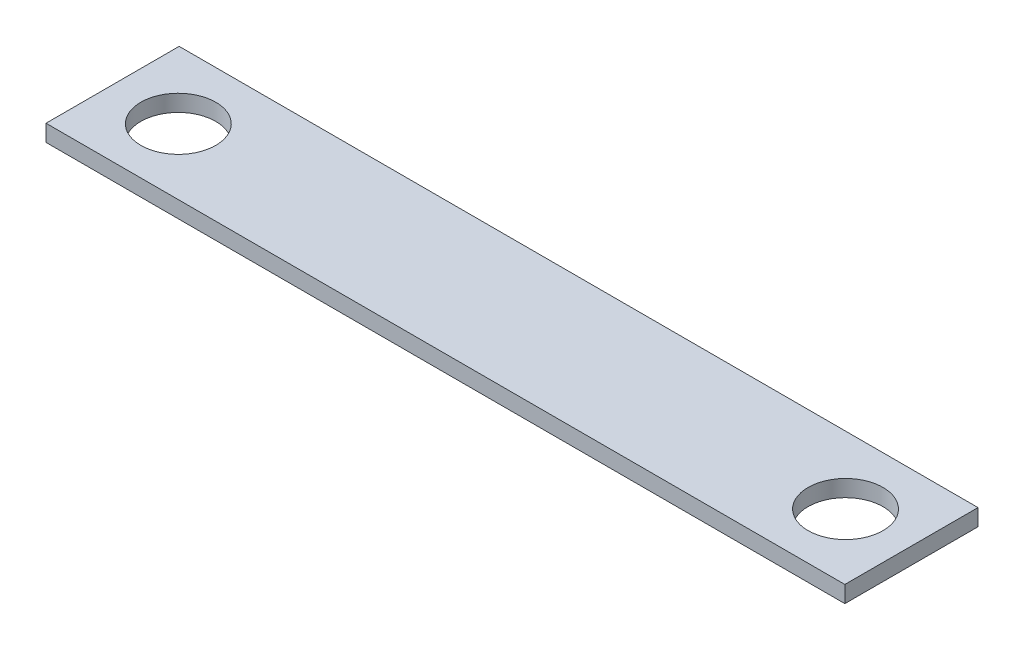
ISO-10303-21;
HEADER;
FILE_DESCRIPTION(('STEP AP214'),'2;1');
FILE_NAME('part.step','',(''),(''),'','','');
FILE_SCHEMA(('AUTOMOTIVE_DESIGN { 1 0 10303 214 1 1 1 1 }'));
ENDSEC;
DATA;
#1=APPLICATION_CONTEXT('core data for automotive mechanical design processes');
#2=APPLICATION_PROTOCOL_DEFINITION('international standard','automotive_design',2000,#1);
#3=PRODUCT_CONTEXT('',#1,'mechanical');
#4=PRODUCT('Part','Part','',(#3));
#5=PRODUCT_RELATED_PRODUCT_CATEGORY('part','',(#4));
#6=PRODUCT_DEFINITION_FORMATION('','',#4);
#7=PRODUCT_DEFINITION_CONTEXT('part definition',#1,'design');
#8=PRODUCT_DEFINITION('design','',#6,#7);
#9=PRODUCT_DEFINITION_SHAPE('','',#8);
#10=(LENGTH_UNIT() NAMED_UNIT(*) SI_UNIT(.MILLI.,.METRE.));
#11=(NAMED_UNIT(*) PLANE_ANGLE_UNIT() SI_UNIT($,.RADIAN.));
#12=(NAMED_UNIT(*) SI_UNIT($,.STERADIAN.) SOLID_ANGLE_UNIT());
#13=UNCERTAINTY_MEASURE_WITH_UNIT(LENGTH_MEASURE(1.E-05),#10,'distance_accuracy_value','');
#14=(GEOMETRIC_REPRESENTATION_CONTEXT(3) GLOBAL_UNCERTAINTY_ASSIGNED_CONTEXT((#13)) GLOBAL_UNIT_ASSIGNED_CONTEXT((#10,
#11,#12)) REPRESENTATION_CONTEXT('',''));
#15=CARTESIAN_POINT('',(0.,0.,0.));
#16=DIRECTION('',(0.,0.,1.));
#17=DIRECTION('',(1.,0.,0.));
#18=AXIS2_PLACEMENT_3D('',#15,#16,#17);
#19=CARTESIAN_POINT('',(-137.846486486486,6.35,-47.7794594594595));
#20=DIRECTION('',(1.,0.,0.));
#21=DIRECTION('',(0.,0.,-1.));
#22=AXIS2_PLACEMENT_3D('',#19,#20,#21);
#23=PLANE('',#22);
#24=DIRECTION('',(0.,0.,1.));
#25=VECTOR('',#24,1.);
#26=CARTESIAN_POINT('',(-137.846486486486,0.,-47.7794594594595));
#27=LINE('',#26,#25);
#28=CARTESIAN_POINT('',(-137.846486486486,0.,-47.7794594594595));
#29=VERTEX_POINT('',#28);
#30=CARTESIAN_POINT('',(-137.846486486486,0.,3.02054054054053));
#31=VERTEX_POINT('',#30);
#32=EDGE_CURVE('E107',#29,#31,#27,.T.);
#33=ORIENTED_EDGE('',*,*,#32,.T.);
#34=DIRECTION('',(0.,-1.,0.));
#35=VECTOR('',#34,1.);
#36=CARTESIAN_POINT('',(-137.846486486486,6.35,3.02054054054053));
#37=LINE('',#36,#35);
#38=CARTESIAN_POINT('',(-137.846486486486,6.35,3.02054054054053));
#39=VERTEX_POINT('',#38);
#40=EDGE_CURVE('E11',#39,#31,#37,.T.);
#41=ORIENTED_EDGE('',*,*,#40,.F.);
#42=DIRECTION('',(0.,0.,1.));
#43=VECTOR('',#42,1.);
#44=CARTESIAN_POINT('',(-137.846486486486,6.35,-47.7794594594595));
#45=LINE('',#44,#43);
#46=CARTESIAN_POINT('',(-137.846486486486,6.35,-47.7794594594595));
#47=VERTEX_POINT('',#46);
#48=EDGE_CURVE('E91',#47,#39,#45,.T.);
#49=ORIENTED_EDGE('',*,*,#48,.F.);
#50=DIRECTION('',(0.,-1.,0.));
#51=VECTOR('',#50,1.);
#52=CARTESIAN_POINT('',(-137.846486486486,6.35,-47.7794594594595));
#53=LINE('',#52,#51);
#54=EDGE_CURVE('E103',#47,#29,#53,.T.);
#55=ORIENTED_EDGE('',*,*,#54,.T.);
#56=EDGE_LOOP('',(#33,#41,#49,#55));
#57=FACE_BOUND('',#56,.T.);
#58=ADVANCED_FACE('F39',(#57),#23,.F.);
#59=CARTESIAN_POINT('',(-137.846486486486,6.35,3.02054054054053));
#60=DIRECTION('',(0.,0.,-1.));
#61=DIRECTION('',(-1.,0.,0.));
#62=AXIS2_PLACEMENT_3D('',#59,#60,#61);
#63=PLANE('',#62);
#64=DIRECTION('',(1.,0.,0.));
#65=VECTOR('',#64,1.);
#66=CARTESIAN_POINT('',(-137.846486486486,0.,3.02054054054053));
#67=LINE('',#66,#65);
#68=CARTESIAN_POINT('',(166.953513513514,0.,3.02054054054053));
#69=VERTEX_POINT('',#68);
#70=EDGE_CURVE('E96',#31,#69,#67,.T.);
#71=ORIENTED_EDGE('',*,*,#70,.T.);
#72=DIRECTION('',(0.,-1.,0.));
#73=VECTOR('',#72,1.);
#74=CARTESIAN_POINT('',(166.953513513514,6.35,3.02054054054053));
#75=LINE('',#74,#73);
#76=CARTESIAN_POINT('',(166.953513513514,6.35,3.02054054054053));
#77=VERTEX_POINT('',#76);
#78=EDGE_CURVE('E48',#77,#69,#75,.T.);
#79=ORIENTED_EDGE('',*,*,#78,.F.);
#80=DIRECTION('',(1.,0.,0.));
#81=VECTOR('',#80,1.);
#82=CARTESIAN_POINT('',(-137.846486486486,6.35,3.02054054054053));
#83=LINE('',#82,#81);
#84=EDGE_CURVE('E86',#39,#77,#83,.T.);
#85=ORIENTED_EDGE('',*,*,#84,.F.);
#86=ORIENTED_EDGE('',*,*,#40,.T.);
#87=EDGE_LOOP('',(#71,#79,#85,#86));
#88=FACE_BOUND('',#87,.T.);
#89=ADVANCED_FACE('F95',(#88),#63,.F.);
#90=CARTESIAN_POINT('',(166.953513513514,6.35,-47.7794594594595));
#91=DIRECTION('',(-1.,0.,0.));
#92=DIRECTION('',(0.,0.,1.));
#93=AXIS2_PLACEMENT_3D('',#90,#91,#92);
#94=PLANE('',#93);
#95=DIRECTION('',(0.,0.,-1.));
#96=VECTOR('',#95,1.);
#97=CARTESIAN_POINT('',(166.953513513514,0.,-47.7794594594595));
#98=LINE('',#97,#96);
#99=CARTESIAN_POINT('',(166.953513513514,0.,-47.7794594594595));
#100=VERTEX_POINT('',#99);
#101=EDGE_CURVE('E73',#69,#100,#98,.T.);
#102=ORIENTED_EDGE('',*,*,#101,.T.);
#103=DIRECTION('',(0.,-1.,0.));
#104=VECTOR('',#103,1.);
#105=CARTESIAN_POINT('',(166.953513513514,6.35,-47.7794594594595));
#106=LINE('',#105,#104);
#107=CARTESIAN_POINT('',(166.953513513514,6.35,-47.7794594594595));
#108=VERTEX_POINT('',#107);
#109=EDGE_CURVE('E98',#108,#100,#106,.T.);
#110=ORIENTED_EDGE('',*,*,#109,.F.);
#111=DIRECTION('',(0.,0.,-1.));
#112=VECTOR('',#111,1.);
#113=CARTESIAN_POINT('',(166.953513513514,6.35,-47.7794594594595));
#114=LINE('',#113,#112);
#115=EDGE_CURVE('E89',#77,#108,#114,.T.);
#116=ORIENTED_EDGE('',*,*,#115,.F.);
#117=ORIENTED_EDGE('',*,*,#78,.T.);
#118=EDGE_LOOP('',(#102,#110,#116,#117));
#119=FACE_BOUND('',#118,.T.);
#120=ADVANCED_FACE('F99',(#119),#94,.F.);
#121=CARTESIAN_POINT('',(-137.846486486486,6.35,-47.7794594594595));
#122=DIRECTION('',(0.,0.,1.));
#123=DIRECTION('',(1.,0.,0.));
#124=AXIS2_PLACEMENT_3D('',#121,#122,#123);
#125=PLANE('',#124);
#126=DIRECTION('',(-1.,0.,0.));
#127=VECTOR('',#126,1.);
#128=CARTESIAN_POINT('',(-137.846486486486,0.,-47.7794594594595));
#129=LINE('',#128,#127);
#130=EDGE_CURVE('E79',#100,#29,#129,.T.);
#131=ORIENTED_EDGE('',*,*,#130,.T.);
#132=ORIENTED_EDGE('',*,*,#54,.F.);
#133=DIRECTION('',(-1.,0.,0.));
#134=VECTOR('',#133,1.);
#135=CARTESIAN_POINT('',(-137.846486486486,6.35,-47.7794594594595));
#136=LINE('',#135,#134);
#137=EDGE_CURVE('E56',#108,#47,#136,.T.);
#138=ORIENTED_EDGE('',*,*,#137,.F.);
#139=ORIENTED_EDGE('',*,*,#109,.T.);
#140=EDGE_LOOP('',(#131,#132,#138,#139));
#141=FACE_BOUND('',#140,.T.);
#142=ADVANCED_FACE('F121',(#141),#125,.F.);
#143=CARTESIAN_POINT('',(0.,6.35,0.));
#144=DIRECTION('',(0.,1.,0.));
#145=DIRECTION('',(0.,0.,1.));
#146=AXIS2_PLACEMENT_3D('',#143,#144,#145);
#147=PLANE('',#146);
#148=CARTESIAN_POINT('',(-112.415422728969,6.35,-22.0276218651188));
#149=DIRECTION('',(0.,1.,0.));
#150=DIRECTION('',(0.,0.,1.));
#151=AXIS2_PLACEMENT_3D('',#148,#149,#150);
#152=CIRCLE('',#151,14.2875);
#153=CARTESIAN_POINT('',(-112.415422728969,6.35,-7.74012186511876));
#154=VERTEX_POINT('',#153);
#155=EDGE_CURVE('E136',#154,#154,#152,.T.);
#156=ORIENTED_EDGE('',*,*,#155,.F.);
#157=EDGE_LOOP('',(#156));
#158=FACE_BOUND('',#157,.T.);
#159=CARTESIAN_POINT('',(142.165858982464,6.35,-22.0276218651188));
#160=DIRECTION('',(0.,1.,0.));
#161=DIRECTION('',(0.,0.,1.));
#162=AXIS2_PLACEMENT_3D('',#159,#160,#161);
#163=CIRCLE('',#162,14.2875);
#164=CARTESIAN_POINT('',(142.165858982464,6.35,-7.74012186511875));
#165=VERTEX_POINT('',#164);
#166=EDGE_CURVE('E128',#165,#165,#163,.T.);
#167=ORIENTED_EDGE('',*,*,#166,.F.);
#168=EDGE_LOOP('',(#167));
#169=FACE_BOUND('',#168,.T.);
#170=ORIENTED_EDGE('',*,*,#48,.T.);
#171=ORIENTED_EDGE('',*,*,#84,.T.);
#172=ORIENTED_EDGE('',*,*,#115,.T.);
#173=ORIENTED_EDGE('',*,*,#137,.T.);
#174=EDGE_LOOP('',(#170,#171,#172,#173));
#175=FACE_BOUND('',#174,.T.);
#176=ADVANCED_FACE('F87',(#158,#169,#175),#147,.T.);
#177=CARTESIAN_POINT('',(0.,0.,0.));
#178=DIRECTION('',(0.,1.,0.));
#179=DIRECTION('',(0.,0.,1.));
#180=AXIS2_PLACEMENT_3D('',#177,#178,#179);
#181=PLANE('',#180);
#182=CARTESIAN_POINT('',(-112.415422728969,0.,-22.0276218651188));
#183=DIRECTION('',(0.,1.,0.));
#184=DIRECTION('',(0.,0.,1.));
#185=AXIS2_PLACEMENT_3D('',#182,#183,#184);
#186=CIRCLE('',#185,14.2875);
#187=CARTESIAN_POINT('',(-112.415422728969,0.,-7.74012186511876));
#188=VERTEX_POINT('',#187);
#189=EDGE_CURVE('E111',#188,#188,#186,.T.);
#190=ORIENTED_EDGE('',*,*,#189,.T.);
#191=EDGE_LOOP('',(#190));
#192=FACE_BOUND('',#191,.T.);
#193=CARTESIAN_POINT('',(142.165858982464,0.,-22.0276218651188));
#194=DIRECTION('',(0.,1.,0.));
#195=DIRECTION('',(0.,0.,1.));
#196=AXIS2_PLACEMENT_3D('',#193,#194,#195);
#197=CIRCLE('',#196,14.2875);
#198=CARTESIAN_POINT('',(142.165858982464,0.,-7.74012186511875));
#199=VERTEX_POINT('',#198);
#200=EDGE_CURVE('E132',#199,#199,#197,.T.);
#201=ORIENTED_EDGE('',*,*,#200,.T.);
#202=EDGE_LOOP('',(#201));
#203=FACE_BOUND('',#202,.T.);
#204=ORIENTED_EDGE('',*,*,#32,.F.);
#205=ORIENTED_EDGE('',*,*,#130,.F.);
#206=ORIENTED_EDGE('',*,*,#101,.F.);
#207=ORIENTED_EDGE('',*,*,#70,.F.);
#208=EDGE_LOOP('',(#204,#205,#206,#207));
#209=FACE_BOUND('',#208,.T.);
#210=ADVANCED_FACE('F124',(#192,#203,#209),#181,.F.);
#211=CARTESIAN_POINT('',(142.165858982464,0.,-22.0276218651188));
#212=DIRECTION('',(0.,1.,0.));
#213=DIRECTION('',(0.,0.,1.));
#214=AXIS2_PLACEMENT_3D('',#211,#212,#213);
#215=CYLINDRICAL_SURFACE('',#214,14.2875);
#216=ORIENTED_EDGE('',*,*,#200,.F.);
#217=EDGE_LOOP('',(#216));
#218=FACE_BOUND('',#217,.T.);
#219=ORIENTED_EDGE('',*,*,#166,.T.);
#220=EDGE_LOOP('',(#219));
#221=FACE_BOUND('',#220,.T.);
#222=ADVANCED_FACE('F149',(#218,#221),#215,.F.);
#223=CARTESIAN_POINT('',(-112.415422728969,0.,-22.0276218651188));
#224=DIRECTION('',(0.,1.,0.));
#225=DIRECTION('',(0.,0.,1.));
#226=AXIS2_PLACEMENT_3D('',#223,#224,#225);
#227=CYLINDRICAL_SURFACE('',#226,14.2875);
#228=ORIENTED_EDGE('',*,*,#189,.F.);
#229=EDGE_LOOP('',(#228));
#230=FACE_BOUND('',#229,.T.);
#231=ORIENTED_EDGE('',*,*,#155,.T.);
#232=EDGE_LOOP('',(#231));
#233=FACE_BOUND('',#232,.T.);
#234=ADVANCED_FACE('F146',(#230,#233),#227,.F.);
#235=CLOSED_SHELL('',(#58,#89,#120,#142,#176,#210,#222,#234));
#236=MANIFOLD_SOLID_BREP('B2',#235);
#237=ADVANCED_BREP_SHAPE_REPRESENTATION('',(#18,#236),#14);
#238=SHAPE_DEFINITION_REPRESENTATION(#9,#237);
ENDSEC;
END-ISO-10303-21;
